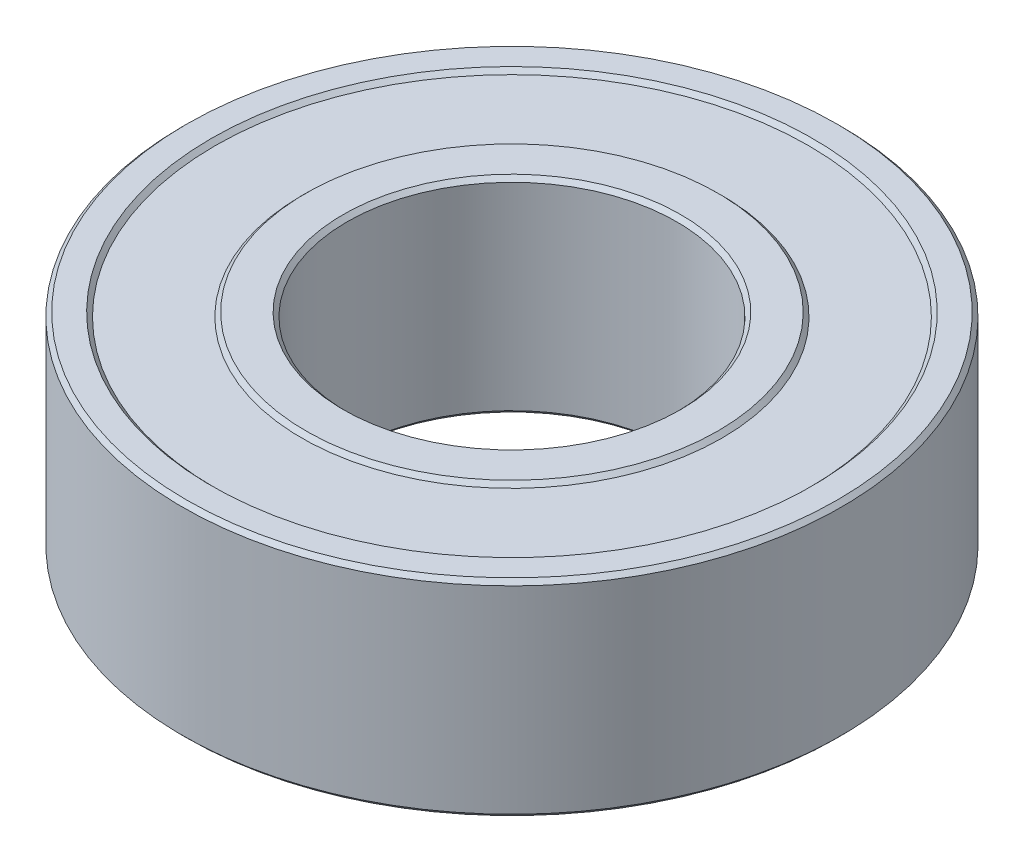
ISO-10303-21;
HEADER;
FILE_DESCRIPTION(('STEP AP214'),'2;1');
FILE_NAME('part.step','',(''),(''),'','','');
FILE_SCHEMA(('AUTOMOTIVE_DESIGN { 1 0 10303 214 1 1 1 1 }'));
ENDSEC;
DATA;
#1=APPLICATION_CONTEXT('core data for automotive mechanical design processes');
#2=APPLICATION_PROTOCOL_DEFINITION('international standard','automotive_design',2000,#1);
#3=PRODUCT_CONTEXT('',#1,'mechanical');
#4=PRODUCT('Part','Part','',(#3));
#5=PRODUCT_RELATED_PRODUCT_CATEGORY('part','',(#4));
#6=PRODUCT_DEFINITION_FORMATION('','',#4);
#7=PRODUCT_DEFINITION_CONTEXT('part definition',#1,'design');
#8=PRODUCT_DEFINITION('design','',#6,#7);
#9=PRODUCT_DEFINITION_SHAPE('','',#8);
#10=(LENGTH_UNIT() NAMED_UNIT(*) SI_UNIT(.MILLI.,.METRE.));
#11=(NAMED_UNIT(*) PLANE_ANGLE_UNIT() SI_UNIT($,.RADIAN.));
#12=(NAMED_UNIT(*) SI_UNIT($,.STERADIAN.) SOLID_ANGLE_UNIT());
#13=UNCERTAINTY_MEASURE_WITH_UNIT(LENGTH_MEASURE(1.E-05),#10,'distance_accuracy_value','');
#14=(GEOMETRIC_REPRESENTATION_CONTEXT(3) GLOBAL_UNCERTAINTY_ASSIGNED_CONTEXT((#13)) GLOBAL_UNIT_ASSIGNED_CONTEXT((#10,
#11,#12)) REPRESENTATION_CONTEXT('',''));
#15=CARTESIAN_POINT('',(0.,0.,0.));
#16=DIRECTION('',(0.,0.,1.));
#17=DIRECTION('',(1.,0.,0.));
#18=AXIS2_PLACEMENT_3D('',#15,#16,#17);
#19=CARTESIAN_POINT('',(0.,1.75,0.));
#20=DIRECTION('',(0.,1.,0.));
#21=DIRECTION('',(1.,0.,0.));
#22=AXIS2_PLACEMENT_3D('',#19,#20,#21);
#23=PLANE('',#22);
#24=CARTESIAN_POINT('',(0.,1.75,0.));
#25=DIRECTION('',(0.,-1.,0.));
#26=DIRECTION('',(-1.,0.,0.));
#27=AXIS2_PLACEMENT_3D('',#24,#25,#26);
#28=CIRCLE('',#27,5.4);
#29=CARTESIAN_POINT('',(5.4,1.75,0.));
#30=VERTEX_POINT('',#29);
#31=EDGE_CURVE('P0_E167',#30,#30,#28,.T.);
#32=ORIENTED_EDGE('',*,*,#31,.T.);
#33=EDGE_LOOP('',(#32));
#34=FACE_BOUND('',#33,.T.);
#35=CARTESIAN_POINT('',(0.,1.75,0.));
#36=DIRECTION('',(0.,1.,0.));
#37=DIRECTION('',(-1.,0.,0.));
#38=AXIS2_PLACEMENT_3D('',#35,#36,#37);
#39=CIRCLE('',#38,5.6);
#40=CARTESIAN_POINT('',(5.6,1.75,0.));
#41=VERTEX_POINT('',#40);
#42=EDGE_CURVE('P0_E28',#41,#41,#39,.T.);
#43=ORIENTED_EDGE('',*,*,#42,.T.);
#44=EDGE_LOOP('',(#43));
#45=FACE_BOUND('',#44,.T.);
#46=ADVANCED_FACE('P0_F17',(#34,#45),#23,.T.);
#47=CARTESIAN_POINT('',(0.,1.,0.));
#48=DIRECTION('',(0.,1.,0.));
#49=DIRECTION('',(-1.,0.,0.));
#50=AXIS2_PLACEMENT_3D('',#47,#48,#49);
#51=CYLINDRICAL_SURFACE('',#50,5.6);
#52=ORIENTED_EDGE('',*,*,#42,.F.);
#53=DIRECTION('',(0.,-1.,0.));
#54=VECTOR('',#53,1.);
#55=CARTESIAN_POINT('',(5.6,1.,0.));
#56=LINE('',#55,#54);
#57=CARTESIAN_POINT('',(5.6,1.,0.));
#58=VERTEX_POINT('',#57);
#59=EDGE_CURVE('P0_E11',#41,#58,#56,.T.);
#60=ORIENTED_EDGE('',*,*,#59,.T.);
#61=CARTESIAN_POINT('',(0.,1.,0.));
#62=DIRECTION('',(0.,1.,0.));
#63=DIRECTION('',(-1.,0.,0.));
#64=AXIS2_PLACEMENT_3D('',#61,#62,#63);
#65=CIRCLE('',#64,5.6);
#66=EDGE_CURVE('P0_E170',#58,#58,#65,.T.);
#67=ORIENTED_EDGE('',*,*,#66,.T.);
#68=ORIENTED_EDGE('',*,*,#59,.F.);
#69=EDGE_LOOP('',(#52,#60,#67,#68));
#70=FACE_BOUND('',#69,.T.);
#71=ADVANCED_FACE('P0_F310',(#70),#51,.T.);
#72=CARTESIAN_POINT('',(0.,1.,0.));
#73=DIRECTION('',(0.,1.,0.));
#74=DIRECTION('',(1.,0.,0.));
#75=AXIS2_PLACEMENT_3D('',#72,#73,#74);
#76=PLANE('',#75);
#77=CARTESIAN_POINT('',(0.,1.,0.));
#78=DIRECTION('',(0.,1.,0.));
#79=DIRECTION('',(1.,0.,0.));
#80=AXIS2_PLACEMENT_3D('',#77,#78,#79);
#81=CIRCLE('',#80,5.1);
#82=CARTESIAN_POINT('',(-5.1,1.,0.));
#83=VERTEX_POINT('',#82);
#84=EDGE_CURVE('P0_E165',#83,#83,#81,.T.);
#85=ORIENTED_EDGE('',*,*,#84,.T.);
#86=EDGE_LOOP('',(#85));
#87=FACE_BOUND('',#86,.T.);
#88=ORIENTED_EDGE('',*,*,#66,.F.);
#89=EDGE_LOOP('',(#88));
#90=FACE_BOUND('',#89,.T.);
#91=ADVANCED_FACE('P0_F279',(#87,#90),#76,.F.);
#92=CARTESIAN_POINT('',(0.,1.75,0.));
#93=DIRECTION('',(0.,1.,0.));
#94=DIRECTION('',(-1.,0.,0.));
#95=AXIS2_PLACEMENT_3D('',#92,#93,#94);
#96=CYLINDRICAL_SURFACE('',#95,5.4);
#97=CARTESIAN_POINT('',(0.,3.25,0.));
#98=DIRECTION('',(0.,1.,0.));
#99=DIRECTION('',(-1.,0.,0.));
#100=AXIS2_PLACEMENT_3D('',#97,#98,#99);
#101=CIRCLE('',#100,5.4);
#102=CARTESIAN_POINT('',(5.4,3.25,0.));
#103=VERTEX_POINT('',#102);
#104=EDGE_CURVE('P0_E141',#103,#103,#101,.T.);
#105=ORIENTED_EDGE('',*,*,#104,.F.);
#106=DIRECTION('',(0.,-1.,0.));
#107=VECTOR('',#106,1.);
#108=CARTESIAN_POINT('',(5.4,1.75,0.));
#109=LINE('',#108,#107);
#110=EDGE_CURVE('P0_E21',#103,#30,#109,.T.);
#111=ORIENTED_EDGE('',*,*,#110,.T.);
#112=ORIENTED_EDGE('',*,*,#31,.F.);
#113=ORIENTED_EDGE('',*,*,#110,.F.);
#114=EDGE_LOOP('',(#105,#111,#112,#113));
#115=FACE_BOUND('',#114,.T.);
#116=ADVANCED_FACE('P0_F273',(#115),#96,.T.);
#117=CARTESIAN_POINT('',(0.,4.,0.));
#118=DIRECTION('',(0.,1.,0.));
#119=DIRECTION('',(1.,0.,0.));
#120=AXIS2_PLACEMENT_3D('',#117,#118,#119);
#121=PLANE('',#120);
#122=CARTESIAN_POINT('',(0.,4.,0.));
#123=DIRECTION('',(0.,-1.,0.));
#124=DIRECTION('',(-1.,0.,0.));
#125=AXIS2_PLACEMENT_3D('',#122,#123,#124);
#126=CIRCLE('',#125,5.1);
#127=CARTESIAN_POINT('',(5.1,4.,0.));
#128=VERTEX_POINT('',#127);
#129=EDGE_CURVE('P0_E171',#128,#128,#126,.T.);
#130=ORIENTED_EDGE('',*,*,#129,.T.);
#131=EDGE_LOOP('',(#130));
#132=FACE_BOUND('',#131,.T.);
#133=CARTESIAN_POINT('',(0.,4.,0.));
#134=DIRECTION('',(0.,1.,0.));
#135=DIRECTION('',(-1.,0.,0.));
#136=AXIS2_PLACEMENT_3D('',#133,#134,#135);
#137=CIRCLE('',#136,5.9);
#138=CARTESIAN_POINT('',(5.9,4.,0.));
#139=VERTEX_POINT('',#138);
#140=EDGE_CURVE('P0_E135',#139,#139,#137,.T.);
#141=ORIENTED_EDGE('',*,*,#140,.T.);
#142=EDGE_LOOP('',(#141));
#143=FACE_BOUND('',#142,.T.);
#144=ADVANCED_FACE('P0_F278',(#132,#143),#121,.T.);
#145=CARTESIAN_POINT('',(0.,3.25,0.));
#146=DIRECTION('',(0.,1.,0.));
#147=DIRECTION('',(-1.,0.,0.));
#148=AXIS2_PLACEMENT_3D('',#145,#146,#147);
#149=CYLINDRICAL_SURFACE('',#148,5.9);
#150=ORIENTED_EDGE('',*,*,#140,.F.);
#151=DIRECTION('',(0.,-1.,0.));
#152=VECTOR('',#151,1.);
#153=CARTESIAN_POINT('',(5.9,3.25,0.));
#154=LINE('',#153,#152);
#155=CARTESIAN_POINT('',(5.9,3.25,0.));
#156=VERTEX_POINT('',#155);
#157=EDGE_CURVE('P0_E133',#139,#156,#154,.T.);
#158=ORIENTED_EDGE('',*,*,#157,.T.);
#159=CARTESIAN_POINT('',(0.,3.25,0.));
#160=DIRECTION('',(0.,1.,0.));
#161=DIRECTION('',(-1.,0.,0.));
#162=AXIS2_PLACEMENT_3D('',#159,#160,#161);
#163=CIRCLE('',#162,5.9);
#164=EDGE_CURVE('P0_E137',#156,#156,#163,.T.);
#165=ORIENTED_EDGE('',*,*,#164,.T.);
#166=ORIENTED_EDGE('',*,*,#157,.F.);
#167=EDGE_LOOP('',(#150,#158,#165,#166));
#168=FACE_BOUND('',#167,.T.);
#169=ADVANCED_FACE('P0_F321',(#168),#149,.T.);
#170=CARTESIAN_POINT('',(0.,3.25,0.));
#171=DIRECTION('',(0.,1.,0.));
#172=DIRECTION('',(1.,0.,0.));
#173=AXIS2_PLACEMENT_3D('',#170,#171,#172);
#174=PLANE('',#173);
#175=ORIENTED_EDGE('',*,*,#104,.T.);
#176=EDGE_LOOP('',(#175));
#177=FACE_BOUND('',#176,.T.);
#178=ORIENTED_EDGE('',*,*,#164,.F.);
#179=EDGE_LOOP('',(#178));
#180=FACE_BOUND('',#179,.T.);
#181=ADVANCED_FACE('P0_F359',(#177,#180),#174,.F.);
#182=CARTESIAN_POINT('',(0.,0.05,0.));
#183=DIRECTION('',(0.,-1.,0.));
#184=DIRECTION('',(1.,0.,0.));
#185=AXIS2_PLACEMENT_3D('',#182,#183,#184);
#186=CONICAL_SURFACE('',#185,4.05,0.785398163397449);
#187=CARTESIAN_POINT('',(0.,0.1,0.));
#188=DIRECTION('',(0.,1.,0.));
#189=DIRECTION('',(1.,0.,0.));
#190=AXIS2_PLACEMENT_3D('',#187,#188,#189);
#191=CIRCLE('',#190,4.);
#192=CARTESIAN_POINT('',(-4.,0.1,0.));
#193=VERTEX_POINT('',#192);
#194=EDGE_CURVE('P0_E150',#193,#193,#191,.T.);
#195=ORIENTED_EDGE('',*,*,#194,.T.);
#196=DIRECTION('',(-0.707106781186548,-0.707106781186547,0.));
#197=VECTOR('',#196,1.);
#198=CARTESIAN_POINT('',(-4.05,0.05,0.));
#199=LINE('',#198,#197);
#200=CARTESIAN_POINT('',(-4.1,0.,0.));
#201=VERTEX_POINT('',#200);
#202=EDGE_CURVE('P0_E142',#193,#201,#199,.T.);
#203=ORIENTED_EDGE('',*,*,#202,.T.);
#204=CARTESIAN_POINT('',(0.,0.,0.));
#205=DIRECTION('',(0.,-1.,0.));
#206=DIRECTION('',(1.,0.,0.));
#207=AXIS2_PLACEMENT_3D('',#204,#205,#206);
#208=CIRCLE('',#207,4.1);
#209=EDGE_CURVE('P0_E161',#201,#201,#208,.T.);
#210=ORIENTED_EDGE('',*,*,#209,.T.);
#211=ORIENTED_EDGE('',*,*,#202,.F.);
#212=EDGE_LOOP('',(#195,#203,#210,#211));
#213=FACE_BOUND('',#212,.T.);
#214=ADVANCED_FACE('P0_F19',(#213),#186,.F.);
#215=CARTESIAN_POINT('',(0.,0.,0.));
#216=DIRECTION('',(0.,1.,0.));
#217=DIRECTION('',(1.,0.,0.));
#218=AXIS2_PLACEMENT_3D('',#215,#216,#217);
#219=CYLINDRICAL_SURFACE('',#218,5.1);
#220=ORIENTED_EDGE('',*,*,#84,.F.);
#221=DIRECTION('',(0.,-1.,0.));
#222=VECTOR('',#221,1.);
#223=CARTESIAN_POINT('',(-5.1,0.,0.));
#224=LINE('',#223,#222);
#225=CARTESIAN_POINT('',(-5.1,0.1,0.));
#226=VERTEX_POINT('',#225);
#227=EDGE_CURVE('P0_E154',#83,#226,#224,.T.);
#228=ORIENTED_EDGE('',*,*,#227,.T.);
#229=CARTESIAN_POINT('',(0.,0.1,0.));
#230=DIRECTION('',(0.,-1.,0.));
#231=DIRECTION('',(1.,0.,0.));
#232=AXIS2_PLACEMENT_3D('',#229,#230,#231);
#233=CIRCLE('',#232,5.1);
#234=EDGE_CURVE('P0_E174',#226,#226,#233,.T.);
#235=ORIENTED_EDGE('',*,*,#234,.F.);
#236=ORIENTED_EDGE('',*,*,#227,.F.);
#237=EDGE_LOOP('',(#220,#228,#235,#236));
#238=FACE_BOUND('',#237,.T.);
#239=ADVANCED_FACE('P0_F207',(#238),#219,.T.);
#240=CARTESIAN_POINT('',(0.,0.,0.));
#241=DIRECTION('',(0.,1.,0.));
#242=DIRECTION('',(1.,0.,0.));
#243=AXIS2_PLACEMENT_3D('',#240,#241,#242);
#244=PLANE('',#243);
#245=ORIENTED_EDGE('',*,*,#209,.F.);
#246=EDGE_LOOP('',(#245));
#247=FACE_BOUND('',#246,.T.);
#248=CARTESIAN_POINT('',(0.,0.,0.));
#249=DIRECTION('',(0.,1.,0.));
#250=DIRECTION('',(1.,0.,0.));
#251=AXIS2_PLACEMENT_3D('',#248,#249,#250);
#252=CIRCLE('',#251,5.);
#253=CARTESIAN_POINT('',(-5.,0.,0.));
#254=VERTEX_POINT('',#253);
#255=EDGE_CURVE('P0_E166',#254,#254,#252,.T.);
#256=ORIENTED_EDGE('',*,*,#255,.F.);
#257=EDGE_LOOP('',(#256));
#258=FACE_BOUND('',#257,.T.);
#259=ADVANCED_FACE('P0_F219',(#247,#258),#244,.F.);
#260=CARTESIAN_POINT('',(0.,0.05,0.));
#261=DIRECTION('',(0.,1.,0.));
#262=DIRECTION('',(1.,0.,0.));
#263=AXIS2_PLACEMENT_3D('',#260,#261,#262);
#264=CONICAL_SURFACE('',#263,5.05,0.785398163397449);
#265=ORIENTED_EDGE('',*,*,#234,.T.);
#266=DIRECTION('',(0.707106781186548,-0.707106781186547,0.));
#267=VECTOR('',#266,1.);
#268=CARTESIAN_POINT('',(-5.05,0.05,0.));
#269=LINE('',#268,#267);
#270=EDGE_CURVE('P0_E175',#226,#254,#269,.T.);
#271=ORIENTED_EDGE('',*,*,#270,.T.);
#272=ORIENTED_EDGE('',*,*,#255,.T.);
#273=ORIENTED_EDGE('',*,*,#270,.F.);
#274=EDGE_LOOP('',(#265,#271,#272,#273));
#275=FACE_BOUND('',#274,.T.);
#276=ADVANCED_FACE('P0_F203',(#275),#264,.T.);
#277=CARTESIAN_POINT('',(0.,4.,0.));
#278=DIRECTION('',(0.,1.,0.));
#279=DIRECTION('',(-1.,0.,0.));
#280=AXIS2_PLACEMENT_3D('',#277,#278,#279);
#281=CYLINDRICAL_SURFACE('',#280,5.1);
#282=CARTESIAN_POINT('',(0.,4.9,0.));
#283=DIRECTION('',(0.,1.,0.));
#284=DIRECTION('',(-1.,0.,0.));
#285=AXIS2_PLACEMENT_3D('',#282,#283,#284);
#286=CIRCLE('',#285,5.1);
#287=CARTESIAN_POINT('',(5.1,4.9,0.));
#288=VERTEX_POINT('',#287);
#289=EDGE_CURVE('P0_E149',#288,#288,#286,.T.);
#290=ORIENTED_EDGE('',*,*,#289,.F.);
#291=DIRECTION('',(0.,-1.,0.));
#292=VECTOR('',#291,1.);
#293=CARTESIAN_POINT('',(5.1,4.,0.));
#294=LINE('',#293,#292);
#295=EDGE_CURVE('P0_E131',#288,#128,#294,.T.);
#296=ORIENTED_EDGE('',*,*,#295,.T.);
#297=ORIENTED_EDGE('',*,*,#129,.F.);
#298=ORIENTED_EDGE('',*,*,#295,.F.);
#299=EDGE_LOOP('',(#290,#296,#297,#298));
#300=FACE_BOUND('',#299,.T.);
#301=ADVANCED_FACE('P0_F288',(#300),#281,.T.);
#302=CARTESIAN_POINT('',(0.,4.95,0.));
#303=DIRECTION('',(0.,-1.,0.));
#304=DIRECTION('',(-1.,0.,0.));
#305=AXIS2_PLACEMENT_3D('',#302,#303,#304);
#306=CONICAL_SURFACE('',#305,5.05,0.785398163397448);
#307=CARTESIAN_POINT('',(0.,5.,0.));
#308=DIRECTION('',(0.,-1.,0.));
#309=DIRECTION('',(-1.,0.,0.));
#310=AXIS2_PLACEMENT_3D('',#307,#308,#309);
#311=CIRCLE('',#310,5.);
#312=CARTESIAN_POINT('',(5.,5.,0.));
#313=VERTEX_POINT('',#312);
#314=EDGE_CURVE('P0_E113',#313,#313,#311,.T.);
#315=ORIENTED_EDGE('',*,*,#314,.T.);
#316=DIRECTION('',(0.707106781186548,-0.707106781186548,0.));
#317=VECTOR('',#316,1.);
#318=CARTESIAN_POINT('',(5.05,4.95,0.));
#319=LINE('',#318,#317);
#320=EDGE_CURVE('P0_E146',#313,#288,#319,.T.);
#321=ORIENTED_EDGE('',*,*,#320,.T.);
#322=ORIENTED_EDGE('',*,*,#289,.T.);
#323=ORIENTED_EDGE('',*,*,#320,.F.);
#324=EDGE_LOOP('',(#315,#321,#322,#323));
#325=FACE_BOUND('',#324,.T.);
#326=ADVANCED_FACE('P0_F255',(#325),#306,.T.);
#327=CARTESIAN_POINT('',(0.,0.,0.));
#328=DIRECTION('',(0.,1.,0.));
#329=DIRECTION('',(1.,0.,0.));
#330=AXIS2_PLACEMENT_3D('',#327,#328,#329);
#331=CYLINDRICAL_SURFACE('',#330,4.);
#332=CARTESIAN_POINT('',(0.,4.9,0.));
#333=DIRECTION('',(0.,-1.,0.));
#334=DIRECTION('',(-1.,0.,0.));
#335=AXIS2_PLACEMENT_3D('',#332,#333,#334);
#336=CIRCLE('',#335,4.);
#337=CARTESIAN_POINT('',(4.,4.9,0.));
#338=VERTEX_POINT('',#337);
#339=CARTESIAN_POINT('',(-4.,4.9,0.));
#340=VERTEX_POINT('',#339);
#341=EDGE_CURVE('P0_E109',#338,#340,#336,.T.);
#342=ORIENTED_EDGE('',*,*,#341,.F.);
#343=CARTESIAN_POINT('',(0.,4.9,0.));
#344=DIRECTION('',(0.,-1.,0.));
#345=DIRECTION('',(-1.,0.,0.));
#346=AXIS2_PLACEMENT_3D('',#343,#344,#345);
#347=CIRCLE('',#346,4.);
#348=EDGE_CURVE('P0_E103',#340,#338,#347,.T.);
#349=ORIENTED_EDGE('',*,*,#348,.F.);
#350=DIRECTION('',(0.,-1.,0.));
#351=VECTOR('',#350,1.);
#352=CARTESIAN_POINT('',(-4.,0.,0.));
#353=LINE('',#352,#351);
#354=EDGE_CURVE('P0_E117',#340,#193,#353,.T.);
#355=ORIENTED_EDGE('',*,*,#354,.T.);
#356=ORIENTED_EDGE('',*,*,#194,.F.);
#357=ORIENTED_EDGE('',*,*,#354,.F.);
#358=EDGE_LOOP('',(#342,#349,#355,#356,#357));
#359=FACE_BOUND('',#358,.T.);
#360=ADVANCED_FACE('P0_F115',(#359),#331,.F.);
#361=CARTESIAN_POINT('',(0.,5.,0.));
#362=DIRECTION('',(0.,1.,0.));
#363=DIRECTION('',(1.,0.,0.));
#364=AXIS2_PLACEMENT_3D('',#361,#362,#363);
#365=PLANE('',#364);
#366=CARTESIAN_POINT('',(0.,5.,0.));
#367=DIRECTION('',(0.,1.,0.));
#368=DIRECTION('',(-1.,0.,0.));
#369=AXIS2_PLACEMENT_3D('',#366,#367,#368);
#370=CIRCLE('',#369,4.1);
#371=CARTESIAN_POINT('',(4.1,5.,0.));
#372=VERTEX_POINT('',#371);
#373=EDGE_CURVE('P0_E121',#372,#372,#370,.T.);
#374=ORIENTED_EDGE('',*,*,#373,.F.);
#375=EDGE_LOOP('',(#374));
#376=FACE_BOUND('',#375,.T.);
#377=ORIENTED_EDGE('',*,*,#314,.F.);
#378=EDGE_LOOP('',(#377));
#379=FACE_BOUND('',#378,.T.);
#380=ADVANCED_FACE('P0_F254',(#376,#379),#365,.T.);
#381=CARTESIAN_POINT('',(0.,4.95,0.));
#382=DIRECTION('',(0.,1.,0.));
#383=DIRECTION('',(-1.,0.,0.));
#384=AXIS2_PLACEMENT_3D('',#381,#382,#383);
#385=CONICAL_SURFACE('',#384,4.05,0.785398163397448);
#386=ORIENTED_EDGE('',*,*,#373,.T.);
#387=DIRECTION('',(-0.707106781186548,-0.707106781186548,0.));
#388=VECTOR('',#387,1.);
#389=CARTESIAN_POINT('',(4.05,4.95,0.));
#390=LINE('',#389,#388);
#391=EDGE_CURVE('P0_E108',#372,#338,#390,.T.);
#392=ORIENTED_EDGE('',*,*,#391,.T.);
#393=ORIENTED_EDGE('',*,*,#341,.T.);
#394=ORIENTED_EDGE('',*,*,#348,.T.);
#395=ORIENTED_EDGE('',*,*,#391,.F.);
#396=EDGE_LOOP('',(#386,#392,#393,#394,#395));
#397=FACE_BOUND('',#396,.T.);
#398=ADVANCED_FACE('P0_F106',(#397),#385,.F.);
#399=CLOSED_SHELL('',(#46,#71,#91,#116,#144,#169,#181,#214,#239,#259,#276,#301,#326,#360,#380,#398));
#400=MANIFOLD_SOLID_BREP('P0_B1',#399);
#401=CARTESIAN_POINT('',(0.,0.05,0.));
#402=DIRECTION('',(0.,-1.,0.));
#403=DIRECTION('',(1.,0.,0.));
#404=AXIS2_PLACEMENT_3D('',#401,#402,#403);
#405=CONICAL_SURFACE('',#404,7.25,0.785398163397449);
#406=CARTESIAN_POINT('',(0.,0.1,0.));
#407=DIRECTION('',(0.,1.,0.));
#408=DIRECTION('',(1.,0.,0.));
#409=AXIS2_PLACEMENT_3D('',#406,#407,#408);
#410=CIRCLE('',#409,7.2);
#411=CARTESIAN_POINT('',(-7.2,0.1,0.));
#412=VERTEX_POINT('',#411);
#413=EDGE_CURVE('P1_E98',#412,#412,#410,.T.);
#414=ORIENTED_EDGE('',*,*,#413,.T.);
#415=DIRECTION('',(-0.707106781186548,-0.707106781186547,0.));
#416=VECTOR('',#415,1.);
#417=CARTESIAN_POINT('',(-7.25,0.05,0.));
#418=LINE('',#417,#416);
#419=CARTESIAN_POINT('',(-7.3,0.,0.));
#420=VERTEX_POINT('',#419);
#421=EDGE_CURVE('P1_E11',#412,#420,#418,.T.);
#422=ORIENTED_EDGE('',*,*,#421,.T.);
#423=CARTESIAN_POINT('',(0.,0.,0.));
#424=DIRECTION('',(0.,-1.,0.));
#425=DIRECTION('',(1.,0.,0.));
#426=AXIS2_PLACEMENT_3D('',#423,#424,#425);
#427=CIRCLE('',#426,7.3);
#428=EDGE_CURVE('P1_E28',#420,#420,#427,.T.);
#429=ORIENTED_EDGE('',*,*,#428,.T.);
#430=ORIENTED_EDGE('',*,*,#421,.F.);
#431=EDGE_LOOP('',(#414,#422,#429,#430));
#432=FACE_BOUND('',#431,.T.);
#433=ADVANCED_FACE('P1_F17',(#432),#405,.F.);
#434=CARTESIAN_POINT('',(0.,0.,0.));
#435=DIRECTION('',(0.,1.,0.));
#436=DIRECTION('',(1.,0.,0.));
#437=AXIS2_PLACEMENT_3D('',#434,#435,#436);
#438=PLANE('',#437);
#439=ORIENTED_EDGE('',*,*,#428,.F.);
#440=EDGE_LOOP('',(#439));
#441=FACE_BOUND('',#440,.T.);
#442=CARTESIAN_POINT('',(0.,0.,0.));
#443=DIRECTION('',(0.,1.,0.));
#444=DIRECTION('',(1.,0.,0.));
#445=AXIS2_PLACEMENT_3D('',#442,#443,#444);
#446=CIRCLE('',#445,7.9);
#447=CARTESIAN_POINT('',(-7.9,0.,0.));
#448=VERTEX_POINT('',#447);
#449=EDGE_CURVE('P1_E97',#448,#448,#446,.T.);
#450=ORIENTED_EDGE('',*,*,#449,.F.);
#451=EDGE_LOOP('',(#450));
#452=FACE_BOUND('',#451,.T.);
#453=ADVANCED_FACE('P1_F117',(#441,#452),#438,.F.);
#454=CARTESIAN_POINT('',(0.,0.05,0.));
#455=DIRECTION('',(0.,1.,0.));
#456=DIRECTION('',(1.,0.,0.));
#457=AXIS2_PLACEMENT_3D('',#454,#455,#456);
#458=CONICAL_SURFACE('',#457,7.95,0.785398163397449);
#459=CARTESIAN_POINT('',(0.,0.1,0.));
#460=DIRECTION('',(0.,-1.,0.));
#461=DIRECTION('',(1.,0.,0.));
#462=AXIS2_PLACEMENT_3D('',#459,#460,#461);
#463=CIRCLE('',#462,8.);
#464=CARTESIAN_POINT('',(-8.,0.1,0.));
#465=VERTEX_POINT('',#464);
#466=EDGE_CURVE('P1_E73',#465,#465,#463,.T.);
#467=ORIENTED_EDGE('',*,*,#466,.T.);
#468=DIRECTION('',(0.707106781186548,-0.707106781186547,0.));
#469=VECTOR('',#468,1.);
#470=CARTESIAN_POINT('',(-7.95,0.05,0.));
#471=LINE('',#470,#469);
#472=EDGE_CURVE('P1_E93',#465,#448,#471,.T.);
#473=ORIENTED_EDGE('',*,*,#472,.T.);
#474=ORIENTED_EDGE('',*,*,#449,.T.);
#475=ORIENTED_EDGE('',*,*,#472,.F.);
#476=EDGE_LOOP('',(#467,#473,#474,#475));
#477=FACE_BOUND('',#476,.T.);
#478=ADVANCED_FACE('P1_F19',(#477),#458,.T.);
#479=CARTESIAN_POINT('',(0.,0.,0.));
#480=DIRECTION('',(0.,1.,0.));
#481=DIRECTION('',(1.,0.,0.));
#482=AXIS2_PLACEMENT_3D('',#479,#480,#481);
#483=CYLINDRICAL_SURFACE('',#482,7.2);
#484=CARTESIAN_POINT('',(0.,4.9,0.));
#485=DIRECTION('',(0.,-1.,0.));
#486=DIRECTION('',(1.,0.,0.));
#487=AXIS2_PLACEMENT_3D('',#484,#485,#486);
#488=CIRCLE('',#487,7.2);
#489=CARTESIAN_POINT('',(-7.2,4.9,0.));
#490=VERTEX_POINT('',#489);
#491=EDGE_CURVE('P1_E103',#490,#490,#488,.T.);
#492=ORIENTED_EDGE('',*,*,#491,.F.);
#493=DIRECTION('',(0.,-1.,0.));
#494=VECTOR('',#493,1.);
#495=CARTESIAN_POINT('',(-7.2,0.,0.));
#496=LINE('',#495,#494);
#497=EDGE_CURVE('P1_E21',#490,#412,#496,.T.);
#498=ORIENTED_EDGE('',*,*,#497,.T.);
#499=ORIENTED_EDGE('',*,*,#413,.F.);
#500=ORIENTED_EDGE('',*,*,#497,.F.);
#501=EDGE_LOOP('',(#492,#498,#499,#500));
#502=FACE_BOUND('',#501,.T.);
#503=ADVANCED_FACE('P1_F126',(#502),#483,.F.);
#504=CARTESIAN_POINT('',(0.,4.95,0.));
#505=DIRECTION('',(0.,1.,0.));
#506=DIRECTION('',(1.,0.,0.));
#507=AXIS2_PLACEMENT_3D('',#504,#505,#506);
#508=CONICAL_SURFACE('',#507,7.25,0.785398163397448);
#509=CARTESIAN_POINT('',(0.,5.,0.));
#510=DIRECTION('',(0.,1.,0.));
#511=DIRECTION('',(1.,0.,0.));
#512=AXIS2_PLACEMENT_3D('',#509,#510,#511);
#513=CIRCLE('',#512,7.3);
#514=CARTESIAN_POINT('',(-7.3,5.,0.));
#515=VERTEX_POINT('',#514);
#516=EDGE_CURVE('P1_E75',#515,#515,#513,.T.);
#517=ORIENTED_EDGE('',*,*,#516,.T.);
#518=DIRECTION('',(0.707106781186548,-0.707106781186548,0.));
#519=VECTOR('',#518,1.);
#520=CARTESIAN_POINT('',(-7.25,4.95,0.));
#521=LINE('',#520,#519);
#522=EDGE_CURVE('P1_E99',#515,#490,#521,.T.);
#523=ORIENTED_EDGE('',*,*,#522,.T.);
#524=ORIENTED_EDGE('',*,*,#491,.T.);
#525=ORIENTED_EDGE('',*,*,#522,.F.);
#526=EDGE_LOOP('',(#517,#523,#524,#525));
#527=FACE_BOUND('',#526,.T.);
#528=ADVANCED_FACE('P1_F133',(#527),#508,.F.);
#529=CARTESIAN_POINT('',(0.,0.,0.));
#530=DIRECTION('',(0.,1.,0.));
#531=DIRECTION('',(1.,0.,0.));
#532=AXIS2_PLACEMENT_3D('',#529,#530,#531);
#533=CYLINDRICAL_SURFACE('',#532,8.);
#534=CARTESIAN_POINT('',(0.,4.9,0.));
#535=DIRECTION('',(0.,1.,0.));
#536=DIRECTION('',(1.,0.,0.));
#537=AXIS2_PLACEMENT_3D('',#534,#535,#536);
#538=CIRCLE('',#537,8.);
#539=CARTESIAN_POINT('',(-8.,4.9,0.));
#540=VERTEX_POINT('',#539);
#541=EDGE_CURVE('P1_E70',#540,#540,#538,.T.);
#542=ORIENTED_EDGE('',*,*,#541,.F.);
#543=DIRECTION('',(0.,-1.,0.));
#544=VECTOR('',#543,1.);
#545=CARTESIAN_POINT('',(-8.,0.,0.));
#546=LINE('',#545,#544);
#547=EDGE_CURVE('P1_E67',#540,#465,#546,.T.);
#548=ORIENTED_EDGE('',*,*,#547,.T.);
#549=ORIENTED_EDGE('',*,*,#466,.F.);
#550=ORIENTED_EDGE('',*,*,#547,.F.);
#551=EDGE_LOOP('',(#542,#548,#549,#550));
#552=FACE_BOUND('',#551,.T.);
#553=ADVANCED_FACE('P1_F69',(#552),#533,.T.);
#554=CARTESIAN_POINT('',(0.,5.,0.));
#555=DIRECTION('',(0.,1.,0.));
#556=DIRECTION('',(1.,0.,0.));
#557=AXIS2_PLACEMENT_3D('',#554,#555,#556);
#558=PLANE('',#557);
#559=ORIENTED_EDGE('',*,*,#516,.F.);
#560=EDGE_LOOP('',(#559));
#561=FACE_BOUND('',#560,.T.);
#562=CARTESIAN_POINT('',(0.,5.,0.));
#563=DIRECTION('',(0.,-1.,0.));
#564=DIRECTION('',(1.,0.,0.));
#565=AXIS2_PLACEMENT_3D('',#562,#563,#564);
#566=CIRCLE('',#565,7.9);
#567=CARTESIAN_POINT('',(-7.9,5.,0.));
#568=VERTEX_POINT('',#567);
#569=EDGE_CURVE('P1_E89',#568,#568,#566,.T.);
#570=ORIENTED_EDGE('',*,*,#569,.F.);
#571=EDGE_LOOP('',(#570));
#572=FACE_BOUND('',#571,.T.);
#573=ADVANCED_FACE('P1_F132',(#561,#572),#558,.T.);
#574=CARTESIAN_POINT('',(0.,4.95,0.));
#575=DIRECTION('',(0.,-1.,0.));
#576=DIRECTION('',(1.,0.,0.));
#577=AXIS2_PLACEMENT_3D('',#574,#575,#576);
#578=CONICAL_SURFACE('',#577,7.95,0.785398163397448);
#579=ORIENTED_EDGE('',*,*,#569,.T.);
#580=DIRECTION('',(-0.707106781186548,-0.707106781186548,0.));
#581=VECTOR('',#580,1.);
#582=CARTESIAN_POINT('',(-7.95,4.95,0.));
#583=LINE('',#582,#581);
#584=EDGE_CURVE('P1_E79',#568,#540,#583,.T.);
#585=ORIENTED_EDGE('',*,*,#584,.T.);
#586=ORIENTED_EDGE('',*,*,#541,.T.);
#587=ORIENTED_EDGE('',*,*,#584,.F.);
#588=EDGE_LOOP('',(#579,#585,#586,#587));
#589=FACE_BOUND('',#588,.T.);
#590=ADVANCED_FACE('P1_F78',(#589),#578,.T.);
#591=CLOSED_SHELL('',(#433,#453,#478,#503,#528,#553,#573,#590));
#592=MANIFOLD_SOLID_BREP('P1_B1',#591);
#593=CARTESIAN_POINT('',(0.,0.8,0.));
#594=DIRECTION('',(0.,-1.,0.));
#595=DIRECTION('',(0.,0.,-1.));
#596=AXIS2_PLACEMENT_3D('',#593,#594,#595);
#597=PLANE('',#596);
#598=CARTESIAN_POINT('',(0.,0.8,0.));
#599=DIRECTION('',(0.,1.,0.));
#600=DIRECTION('',(1.,0.,0.));
#601=AXIS2_PLACEMENT_3D('',#598,#599,#600);
#602=CIRCLE('',#601,5.1);
#603=CARTESIAN_POINT('',(-5.1,0.8,0.));
#604=VERTEX_POINT('',#603);
#605=EDGE_CURVE('P2_E20',#604,#604,#602,.T.);
#606=ORIENTED_EDGE('',*,*,#605,.F.);
#607=EDGE_LOOP('',(#606));
#608=FACE_BOUND('',#607,.T.);
#609=CARTESIAN_POINT('',(0.,0.8,0.));
#610=DIRECTION('',(0.,-1.,0.));
#611=DIRECTION('',(1.,0.,0.));
#612=AXIS2_PLACEMENT_3D('',#609,#610,#611);
#613=CIRCLE('',#612,7.5);
#614=CARTESIAN_POINT('',(-7.5,0.8,0.));
#615=VERTEX_POINT('',#614);
#616=EDGE_CURVE('P2_E11',#615,#615,#613,.T.);
#617=ORIENTED_EDGE('',*,*,#616,.F.);
#618=EDGE_LOOP('',(#617));
#619=FACE_BOUND('',#618,.T.);
#620=ADVANCED_FACE('P2_F17',(#608,#619),#597,.F.);
#621=CARTESIAN_POINT('',(0.,0.8,0.));
#622=DIRECTION('',(0.,-1.,0.));
#623=DIRECTION('',(1.,0.,0.));
#624=AXIS2_PLACEMENT_3D('',#621,#622,#623);
#625=CYLINDRICAL_SURFACE('',#624,7.5);
#626=CARTESIAN_POINT('',(0.,0.1,0.));
#627=DIRECTION('',(0.,-1.,0.));
#628=DIRECTION('',(1.,0.,0.));
#629=AXIS2_PLACEMENT_3D('',#626,#627,#628);
#630=CIRCLE('',#629,7.5);
#631=CARTESIAN_POINT('',(-7.5,0.1,0.));
#632=VERTEX_POINT('',#631);
#633=EDGE_CURVE('P2_E56',#632,#632,#630,.T.);
#634=ORIENTED_EDGE('',*,*,#633,.F.);
#635=DIRECTION('',(0.,1.,0.));
#636=VECTOR('',#635,1.);
#637=CARTESIAN_POINT('',(-7.5,0.8,0.));
#638=LINE('',#637,#636);
#639=EDGE_CURVE('P2_E27',#632,#615,#638,.T.);
#640=ORIENTED_EDGE('',*,*,#639,.T.);
#641=ORIENTED_EDGE('',*,*,#616,.T.);
#642=ORIENTED_EDGE('',*,*,#639,.F.);
#643=EDGE_LOOP('',(#634,#640,#641,#642));
#644=FACE_BOUND('',#643,.T.);
#645=ADVANCED_FACE('P2_F55',(#644),#625,.T.);
#646=CARTESIAN_POINT('',(0.,0.8,0.));
#647=DIRECTION('',(0.,-1.,0.));
#648=DIRECTION('',(1.,0.,0.));
#649=AXIS2_PLACEMENT_3D('',#646,#647,#648);
#650=CYLINDRICAL_SURFACE('',#649,5.1);
#651=CARTESIAN_POINT('',(0.,0.1,0.));
#652=DIRECTION('',(0.,1.,0.));
#653=DIRECTION('',(1.,0.,0.));
#654=AXIS2_PLACEMENT_3D('',#651,#652,#653);
#655=CIRCLE('',#654,5.1);
#656=CARTESIAN_POINT('',(-5.1,0.1,0.));
#657=VERTEX_POINT('',#656);
#658=EDGE_CURVE('P2_E62',#657,#657,#655,.T.);
#659=ORIENTED_EDGE('',*,*,#658,.F.);
#660=DIRECTION('',(0.,1.,0.));
#661=VECTOR('',#660,1.);
#662=CARTESIAN_POINT('',(-5.1,0.8,0.));
#663=LINE('',#662,#661);
#664=EDGE_CURVE('P2_E49',#657,#604,#663,.T.);
#665=ORIENTED_EDGE('',*,*,#664,.T.);
#666=ORIENTED_EDGE('',*,*,#605,.T.);
#667=ORIENTED_EDGE('',*,*,#664,.F.);
#668=EDGE_LOOP('',(#659,#665,#666,#667));
#669=FACE_BOUND('',#668,.T.);
#670=ADVANCED_FACE('P2_F76',(#669),#650,.F.);
#671=CARTESIAN_POINT('',(0.,0.1,0.));
#672=DIRECTION('',(0.,-1.,0.));
#673=DIRECTION('',(0.,0.,-1.));
#674=AXIS2_PLACEMENT_3D('',#671,#672,#673);
#675=PLANE('',#674);
#676=ORIENTED_EDGE('',*,*,#658,.T.);
#677=EDGE_LOOP('',(#676));
#678=FACE_BOUND('',#677,.T.);
#679=ORIENTED_EDGE('',*,*,#633,.T.);
#680=EDGE_LOOP('',(#679));
#681=FACE_BOUND('',#680,.T.);
#682=ADVANCED_FACE('P2_F60',(#678,#681),#675,.T.);
#683=CLOSED_SHELL('',(#620,#645,#670,#682));
#684=MANIFOLD_SOLID_BREP('P2_B1',#683);
#685=CARTESIAN_POINT('',(0.,4.4,0.));
#686=DIRECTION('',(0.,1.,0.));
#687=DIRECTION('',(1.,0.,0.));
#688=AXIS2_PLACEMENT_3D('',#685,#686,#687);
#689=PLANE('',#688);
#690=CARTESIAN_POINT('',(0.,4.4,0.));
#691=DIRECTION('',(0.,-1.,0.));
#692=DIRECTION('',(-1.,0.,0.));
#693=AXIS2_PLACEMENT_3D('',#690,#691,#692);
#694=CIRCLE('',#693,5.1);
#695=CARTESIAN_POINT('',(5.1,4.4,0.));
#696=VERTEX_POINT('',#695);
#697=EDGE_CURVE('P3_E59',#696,#696,#694,.T.);
#698=ORIENTED_EDGE('',*,*,#697,.F.);
#699=EDGE_LOOP('',(#698));
#700=FACE_BOUND('',#699,.T.);
#701=CARTESIAN_POINT('',(0.,4.4,0.));
#702=DIRECTION('',(0.,1.,0.));
#703=DIRECTION('',(-1.,0.,0.));
#704=AXIS2_PLACEMENT_3D('',#701,#702,#703);
#705=CIRCLE('',#704,7.5);
#706=CARTESIAN_POINT('',(7.5,4.4,0.));
#707=VERTEX_POINT('',#706);
#708=EDGE_CURVE('P3_E11',#707,#707,#705,.T.);
#709=ORIENTED_EDGE('',*,*,#708,.F.);
#710=EDGE_LOOP('',(#709));
#711=FACE_BOUND('',#710,.T.);
#712=ADVANCED_FACE('P3_F17',(#700,#711),#689,.F.);
#713=CARTESIAN_POINT('',(0.,4.4,0.));
#714=DIRECTION('',(0.,1.,0.));
#715=DIRECTION('',(-1.,0.,0.));
#716=AXIS2_PLACEMENT_3D('',#713,#714,#715);
#717=CYLINDRICAL_SURFACE('',#716,7.5);
#718=CARTESIAN_POINT('',(0.,4.9,0.));
#719=DIRECTION('',(0.,1.,0.));
#720=DIRECTION('',(-1.,0.,0.));
#721=AXIS2_PLACEMENT_3D('',#718,#719,#720);
#722=CIRCLE('',#721,7.5);
#723=CARTESIAN_POINT('',(7.5,4.9,0.));
#724=VERTEX_POINT('',#723);
#725=EDGE_CURVE('P3_E57',#724,#724,#722,.T.);
#726=ORIENTED_EDGE('',*,*,#725,.F.);
#727=DIRECTION('',(0.,-1.,0.));
#728=VECTOR('',#727,1.);
#729=CARTESIAN_POINT('',(7.5,4.4,0.));
#730=LINE('',#729,#728);
#731=EDGE_CURVE('P3_E27',#724,#707,#730,.T.);
#732=ORIENTED_EDGE('',*,*,#731,.T.);
#733=ORIENTED_EDGE('',*,*,#708,.T.);
#734=ORIENTED_EDGE('',*,*,#731,.F.);
#735=EDGE_LOOP('',(#726,#732,#733,#734));
#736=FACE_BOUND('',#735,.T.);
#737=ADVANCED_FACE('P3_F56',(#736),#717,.T.);
#738=CARTESIAN_POINT('',(0.,4.4,0.));
#739=DIRECTION('',(0.,1.,0.));
#740=DIRECTION('',(-1.,0.,0.));
#741=AXIS2_PLACEMENT_3D('',#738,#739,#740);
#742=CYLINDRICAL_SURFACE('',#741,5.1);
#743=CARTESIAN_POINT('',(0.,4.9,0.));
#744=DIRECTION('',(0.,-1.,0.));
#745=DIRECTION('',(-1.,0.,0.));
#746=AXIS2_PLACEMENT_3D('',#743,#744,#745);
#747=CIRCLE('',#746,5.1);
#748=CARTESIAN_POINT('',(5.1,4.9,0.));
#749=VERTEX_POINT('',#748);
#750=EDGE_CURVE('P3_E20',#749,#749,#747,.T.);
#751=ORIENTED_EDGE('',*,*,#750,.F.);
#752=DIRECTION('',(0.,-1.,0.));
#753=VECTOR('',#752,1.);
#754=CARTESIAN_POINT('',(5.1,4.4,0.));
#755=LINE('',#754,#753);
#756=EDGE_CURVE('P3_E50',#749,#696,#755,.T.);
#757=ORIENTED_EDGE('',*,*,#756,.T.);
#758=ORIENTED_EDGE('',*,*,#697,.T.);
#759=ORIENTED_EDGE('',*,*,#756,.F.);
#760=EDGE_LOOP('',(#751,#757,#758,#759));
#761=FACE_BOUND('',#760,.T.);
#762=ADVANCED_FACE('P3_F77',(#761),#742,.F.);
#763=CARTESIAN_POINT('',(0.,4.9,0.));
#764=DIRECTION('',(0.,1.,0.));
#765=DIRECTION('',(1.,0.,0.));
#766=AXIS2_PLACEMENT_3D('',#763,#764,#765);
#767=PLANE('',#766);
#768=ORIENTED_EDGE('',*,*,#750,.T.);
#769=EDGE_LOOP('',(#768));
#770=FACE_BOUND('',#769,.T.);
#771=ORIENTED_EDGE('',*,*,#725,.T.);
#772=EDGE_LOOP('',(#771));
#773=FACE_BOUND('',#772,.T.);
#774=ADVANCED_FACE('P3_F62',(#770,#773),#767,.T.);
#775=CLOSED_SHELL('',(#712,#737,#762,#774));
#776=MANIFOLD_SOLID_BREP('P3_B1',#775);
#777=ADVANCED_BREP_SHAPE_REPRESENTATION('',(#18,#400,#592,#684,#776),#14);
#778=SHAPE_DEFINITION_REPRESENTATION(#9,#777);
ENDSEC;
END-ISO-10303-21;
